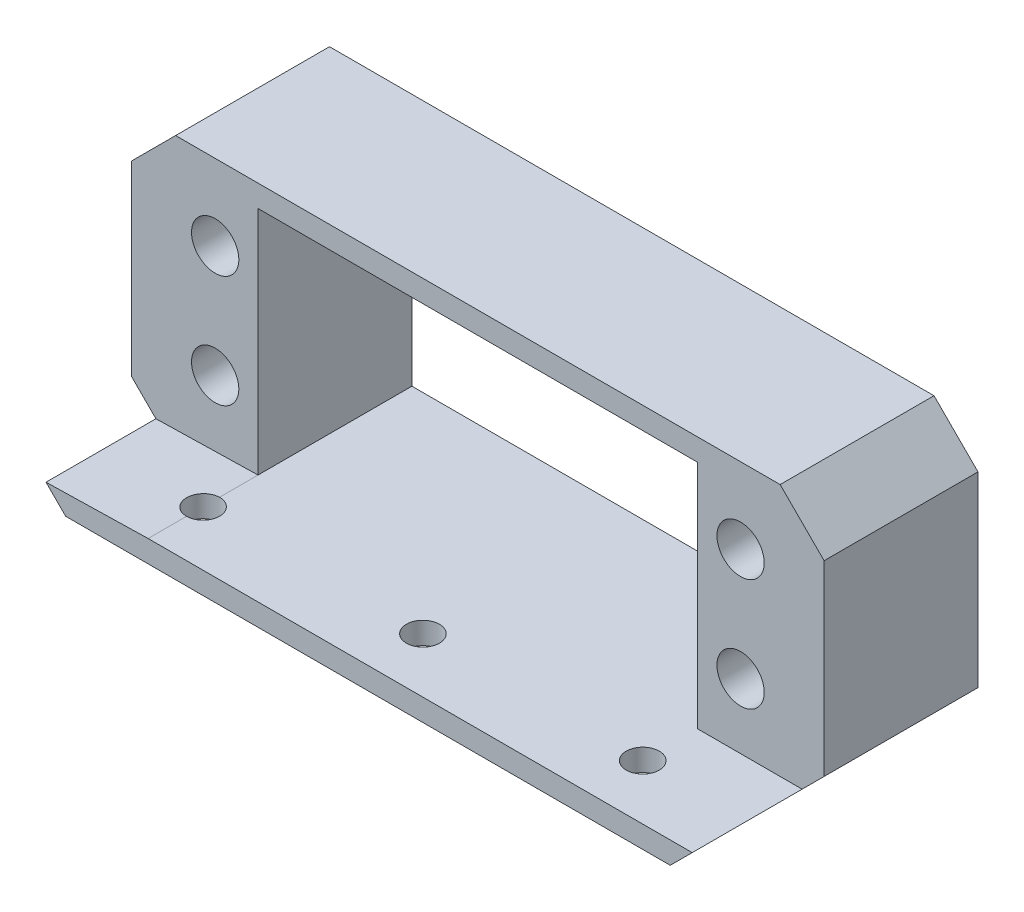
ISO-10303-21;
HEADER;
FILE_DESCRIPTION(('STEP AP214'),'2;1');
FILE_NAME('part.step','',(''),(''),'','','');
FILE_SCHEMA(('AUTOMOTIVE_DESIGN { 1 0 10303 214 1 1 1 1 }'));
ENDSEC;
DATA;
#1=APPLICATION_CONTEXT('core data for automotive mechanical design processes');
#2=APPLICATION_PROTOCOL_DEFINITION('international standard','automotive_design',2000,#1);
#3=PRODUCT_CONTEXT('',#1,'mechanical');
#4=PRODUCT('Part','Part','',(#3));
#5=PRODUCT_RELATED_PRODUCT_CATEGORY('part','',(#4));
#6=PRODUCT_DEFINITION_FORMATION('','',#4);
#7=PRODUCT_DEFINITION_CONTEXT('part definition',#1,'design');
#8=PRODUCT_DEFINITION('design','',#6,#7);
#9=PRODUCT_DEFINITION_SHAPE('','',#8);
#10=(LENGTH_UNIT() NAMED_UNIT(*) SI_UNIT(.MILLI.,.METRE.));
#11=(NAMED_UNIT(*) PLANE_ANGLE_UNIT() SI_UNIT($,.RADIAN.));
#12=(NAMED_UNIT(*) SI_UNIT($,.STERADIAN.) SOLID_ANGLE_UNIT());
#13=UNCERTAINTY_MEASURE_WITH_UNIT(LENGTH_MEASURE(1.E-05),#10,'distance_accuracy_value','');
#14=(GEOMETRIC_REPRESENTATION_CONTEXT(3) GLOBAL_UNCERTAINTY_ASSIGNED_CONTEXT((#13)) GLOBAL_UNIT_ASSIGNED_CONTEXT((#10,
#11,#12)) REPRESENTATION_CONTEXT('',''));
#15=CARTESIAN_POINT('',(0.,0.,0.));
#16=DIRECTION('',(0.,0.,1.));
#17=DIRECTION('',(1.,0.,0.));
#18=AXIS2_PLACEMENT_3D('',#15,#16,#17);
#19=CARTESIAN_POINT('',(0.,0.,14.));
#20=DIRECTION('',(0.,0.,1.));
#21=DIRECTION('',(1.,0.,0.));
#22=AXIS2_PLACEMENT_3D('',#19,#20,#21);
#23=PLANE('',#22);
#24=DIRECTION('',(-0.999745415991808,-0.0225633154338214,0.));
#25=VECTOR('',#24,1.);
#26=CARTESIAN_POINT('',(-20.,-10.5,14.));
#27=LINE('',#26,#25);
#28=CARTESIAN_POINT('',(-20.,-10.5,14.));
#29=VERTEX_POINT('',#28);
#30=CARTESIAN_POINT('',(-29.2903260629278,-10.7096739370722,14.));
#31=VERTEX_POINT('',#30);
#32=EDGE_CURVE('E281',#29,#31,#27,.T.);
#33=ORIENTED_EDGE('',*,*,#32,.F.);
#34=DIRECTION('',(0.,-1.,0.));
#35=VECTOR('',#34,1.);
#36=CARTESIAN_POINT('',(-20.,10.5,14.));
#37=LINE('',#36,#35);
#38=CARTESIAN_POINT('',(-20.,10.5,14.));
#39=VERTEX_POINT('',#38);
#40=EDGE_CURVE('E199',#39,#29,#37,.T.);
#41=ORIENTED_EDGE('',*,*,#40,.F.);
#42=DIRECTION('',(-1.,0.,0.));
#43=VECTOR('',#42,1.);
#44=CARTESIAN_POINT('',(-20.,10.5,14.));
#45=LINE('',#44,#43);
#46=CARTESIAN_POINT('',(20.,10.5,14.));
#47=VERTEX_POINT('',#46);
#48=EDGE_CURVE('E196',#47,#39,#45,.T.);
#49=ORIENTED_EDGE('',*,*,#48,.F.);
#50=DIRECTION('',(0.,1.,0.));
#51=VECTOR('',#50,1.);
#52=CARTESIAN_POINT('',(20.,10.5,14.));
#53=LINE('',#52,#51);
#54=CARTESIAN_POINT('',(20.,-10.5,14.));
#55=VERTEX_POINT('',#54);
#56=EDGE_CURVE('E194',#55,#47,#53,.T.);
#57=ORIENTED_EDGE('',*,*,#56,.F.);
#58=DIRECTION('',(-1.,0.,0.));
#59=VECTOR('',#58,1.);
#60=CARTESIAN_POINT('',(-20.,-10.5,14.));
#61=LINE('',#60,#59);
#62=CARTESIAN_POINT('',(29.5,-10.5,14.));
#63=VERTEX_POINT('',#62);
#64=EDGE_CURVE('E278',#63,#55,#61,.T.);
#65=ORIENTED_EDGE('',*,*,#64,.F.);
#66=DIRECTION('',(0.707106781186548,0.707106781186547,0.));
#67=VECTOR('',#66,1.);
#68=CARTESIAN_POINT('',(27.5,-12.5,14.));
#69=LINE('',#68,#67);
#70=CARTESIAN_POINT('',(31.5,-8.49999999999999,14.));
#71=VERTEX_POINT('',#70);
#72=EDGE_CURVE('E233',#63,#71,#69,.T.);
#73=ORIENTED_EDGE('',*,*,#72,.T.);
#74=DIRECTION('',(0.,1.,0.));
#75=VECTOR('',#74,1.);
#76=CARTESIAN_POINT('',(31.5,8.5,14.));
#77=LINE('',#76,#75);
#78=CARTESIAN_POINT('',(31.5,8.5,14.));
#79=VERTEX_POINT('',#78);
#80=EDGE_CURVE('E235',#71,#79,#77,.T.);
#81=ORIENTED_EDGE('',*,*,#80,.T.);
#82=DIRECTION('',(-0.707106781186548,0.707106781186547,0.));
#83=VECTOR('',#82,1.);
#84=CARTESIAN_POINT('',(27.5,12.5,14.));
#85=LINE('',#84,#83);
#86=CARTESIAN_POINT('',(27.5,12.5,14.));
#87=VERTEX_POINT('',#86);
#88=EDGE_CURVE('E220',#79,#87,#85,.T.);
#89=ORIENTED_EDGE('',*,*,#88,.T.);
#90=DIRECTION('',(-1.,0.,0.));
#91=VECTOR('',#90,1.);
#92=CARTESIAN_POINT('',(-27.5,12.5,14.));
#93=LINE('',#92,#91);
#94=CARTESIAN_POINT('',(-27.5,12.5,14.));
#95=VERTEX_POINT('',#94);
#96=EDGE_CURVE('E223',#87,#95,#93,.T.);
#97=ORIENTED_EDGE('',*,*,#96,.T.);
#98=DIRECTION('',(-0.707106781186548,-0.707106781186547,0.));
#99=VECTOR('',#98,1.);
#100=CARTESIAN_POINT('',(-27.5,12.5,14.));
#101=LINE('',#100,#99);
#102=CARTESIAN_POINT('',(-31.5,8.5,14.));
#103=VERTEX_POINT('',#102);
#104=EDGE_CURVE('E226',#95,#103,#101,.T.);
#105=ORIENTED_EDGE('',*,*,#104,.T.);
#106=DIRECTION('',(0.,-1.,0.));
#107=VECTOR('',#106,1.);
#108=CARTESIAN_POINT('',(-31.5,8.5,14.));
#109=LINE('',#108,#107);
#110=CARTESIAN_POINT('',(-31.5,-8.49999999999999,14.));
#111=VERTEX_POINT('',#110);
#112=EDGE_CURVE('E228',#103,#111,#109,.T.);
#113=ORIENTED_EDGE('',*,*,#112,.T.);
#114=DIRECTION('',(0.707106781186548,-0.707106781186547,0.));
#115=VECTOR('',#114,1.);
#116=CARTESIAN_POINT('',(-27.5,-12.5,14.));
#117=LINE('',#116,#115);
#118=EDGE_CURVE('E230',#111,#31,#117,.T.);
#119=ORIENTED_EDGE('',*,*,#118,.T.);
#120=EDGE_LOOP('',(#33,#41,#49,#57,#65,#73,#81,#89,#97,#105,#113,#119));
#121=FACE_BOUND('',#120,.T.);
#122=CARTESIAN_POINT('',(23.9,-4.60000000000001,14.));
#123=DIRECTION('',(0.,0.,-1.));
#124=DIRECTION('',(-1.,0.,0.));
#125=AXIS2_PLACEMENT_3D('',#122,#123,#124);
#126=CIRCLE('',#125,2.15);
#127=CARTESIAN_POINT('',(21.75,-4.60000000000001,14.));
#128=VERTEX_POINT('',#127);
#129=EDGE_CURVE('E177',#128,#128,#126,.T.);
#130=ORIENTED_EDGE('',*,*,#129,.T.);
#131=EDGE_LOOP('',(#130));
#132=FACE_BOUND('',#131,.T.);
#133=CARTESIAN_POINT('',(-23.8999999999999,5.59999999999998,14.));
#134=DIRECTION('',(0.,0.,-1.));
#135=DIRECTION('',(-1.,0.,0.));
#136=AXIS2_PLACEMENT_3D('',#133,#134,#135);
#137=CIRCLE('',#136,2.15);
#138=CARTESIAN_POINT('',(-26.0499999999999,5.59999999999998,14.));
#139=VERTEX_POINT('',#138);
#140=EDGE_CURVE('E184',#139,#139,#137,.T.);
#141=ORIENTED_EDGE('',*,*,#140,.T.);
#142=EDGE_LOOP('',(#141));
#143=FACE_BOUND('',#142,.T.);
#144=CARTESIAN_POINT('',(-23.8999999999999,-4.60000000000001,14.));
#145=DIRECTION('',(0.,0.,-1.));
#146=DIRECTION('',(-1.,0.,0.));
#147=AXIS2_PLACEMENT_3D('',#144,#145,#146);
#148=CIRCLE('',#147,2.15);
#149=CARTESIAN_POINT('',(-26.05,-4.60000000000001,14.));
#150=VERTEX_POINT('',#149);
#151=EDGE_CURVE('E171',#150,#150,#148,.T.);
#152=ORIENTED_EDGE('',*,*,#151,.T.);
#153=EDGE_LOOP('',(#152));
#154=FACE_BOUND('',#153,.T.);
#155=CARTESIAN_POINT('',(23.9,5.59999999999999,14.));
#156=DIRECTION('',(0.,0.,-1.));
#157=DIRECTION('',(-1.,0.,0.));
#158=AXIS2_PLACEMENT_3D('',#155,#156,#157);
#159=CIRCLE('',#158,2.15);
#160=CARTESIAN_POINT('',(21.75,5.59999999999999,14.));
#161=VERTEX_POINT('',#160);
#162=EDGE_CURVE('E189',#161,#161,#159,.T.);
#163=ORIENTED_EDGE('',*,*,#162,.T.);
#164=EDGE_LOOP('',(#163));
#165=FACE_BOUND('',#164,.T.);
#166=ADVANCED_FACE('F33',(#121,#132,#143,#154,#165),#23,.T.);
#167=CARTESIAN_POINT('',(0.,0.,0.));
#168=DIRECTION('',(0.,0.,1.));
#169=DIRECTION('',(1.,0.,0.));
#170=AXIS2_PLACEMENT_3D('',#167,#168,#169);
#171=PLANE('',#170);
#172=CARTESIAN_POINT('',(23.9,-4.60000000000001,0.));
#173=DIRECTION('',(0.,0.,-1.));
#174=DIRECTION('',(-1.,0.,0.));
#175=AXIS2_PLACEMENT_3D('',#172,#173,#174);
#176=CIRCLE('',#175,2.15);
#177=CARTESIAN_POINT('',(21.75,-4.60000000000001,0.));
#178=VERTEX_POINT('',#177);
#179=EDGE_CURVE('E181',#178,#178,#176,.T.);
#180=ORIENTED_EDGE('',*,*,#179,.F.);
#181=EDGE_LOOP('',(#180));
#182=FACE_BOUND('',#181,.T.);
#183=CARTESIAN_POINT('',(-23.8999999999999,5.59999999999998,0.));
#184=DIRECTION('',(0.,0.,-1.));
#185=DIRECTION('',(-1.,0.,0.));
#186=AXIS2_PLACEMENT_3D('',#183,#184,#185);
#187=CIRCLE('',#186,2.15);
#188=CARTESIAN_POINT('',(-26.0499999999999,5.59999999999998,0.));
#189=VERTEX_POINT('',#188);
#190=EDGE_CURVE('E174',#189,#189,#187,.T.);
#191=ORIENTED_EDGE('',*,*,#190,.F.);
#192=EDGE_LOOP('',(#191));
#193=FACE_BOUND('',#192,.T.);
#194=CARTESIAN_POINT('',(-23.8999999999999,-4.60000000000001,0.));
#195=DIRECTION('',(0.,0.,-1.));
#196=DIRECTION('',(-1.,0.,0.));
#197=AXIS2_PLACEMENT_3D('',#194,#195,#196);
#198=CIRCLE('',#197,2.15);
#199=CARTESIAN_POINT('',(-26.05,-4.60000000000001,0.));
#200=VERTEX_POINT('',#199);
#201=EDGE_CURVE('E165',#200,#200,#198,.T.);
#202=ORIENTED_EDGE('',*,*,#201,.F.);
#203=EDGE_LOOP('',(#202));
#204=FACE_BOUND('',#203,.T.);
#205=CARTESIAN_POINT('',(23.9,5.59999999999999,0.));
#206=DIRECTION('',(0.,0.,-1.));
#207=DIRECTION('',(-1.,0.,0.));
#208=AXIS2_PLACEMENT_3D('',#205,#206,#207);
#209=CIRCLE('',#208,2.15);
#210=CARTESIAN_POINT('',(21.75,5.59999999999999,0.));
#211=VERTEX_POINT('',#210);
#212=EDGE_CURVE('E180',#211,#211,#209,.T.);
#213=ORIENTED_EDGE('',*,*,#212,.F.);
#214=EDGE_LOOP('',(#213));
#215=FACE_BOUND('',#214,.T.);
#216=DIRECTION('',(-0.707106781186548,0.707106781186547,0.));
#217=VECTOR('',#216,1.);
#218=CARTESIAN_POINT('',(27.5,12.5,0.));
#219=LINE('',#218,#217);
#220=CARTESIAN_POINT('',(31.5,8.5,0.));
#221=VERTEX_POINT('',#220);
#222=CARTESIAN_POINT('',(27.5,12.5,0.));
#223=VERTEX_POINT('',#222);
#224=EDGE_CURVE('E219',#221,#223,#219,.T.);
#225=ORIENTED_EDGE('',*,*,#224,.F.);
#226=DIRECTION('',(0.,1.,0.));
#227=VECTOR('',#226,1.);
#228=CARTESIAN_POINT('',(31.5,8.5,0.));
#229=LINE('',#228,#227);
#230=CARTESIAN_POINT('',(31.5,-8.49999999999999,0.));
#231=VERTEX_POINT('',#230);
#232=EDGE_CURVE('E224',#231,#221,#229,.T.);
#233=ORIENTED_EDGE('',*,*,#232,.F.);
#234=DIRECTION('',(0.707106781186548,0.707106781186547,0.));
#235=VECTOR('',#234,1.);
#236=CARTESIAN_POINT('',(27.5,-12.5,0.));
#237=LINE('',#236,#235);
#238=CARTESIAN_POINT('',(27.5,-12.5,0.));
#239=VERTEX_POINT('',#238);
#240=EDGE_CURVE('E250',#239,#231,#237,.T.);
#241=ORIENTED_EDGE('',*,*,#240,.F.);
#242=DIRECTION('',(1.,0.,0.));
#243=VECTOR('',#242,1.);
#244=CARTESIAN_POINT('',(-27.5,-12.5,0.));
#245=LINE('',#244,#243);
#246=CARTESIAN_POINT('',(-27.5,-12.5,0.));
#247=VERTEX_POINT('',#246);
#248=EDGE_CURVE('E248',#247,#239,#245,.T.);
#249=ORIENTED_EDGE('',*,*,#248,.F.);
#250=DIRECTION('',(0.707106781186548,-0.707106781186547,0.));
#251=VECTOR('',#250,1.);
#252=CARTESIAN_POINT('',(-27.5,-12.5,0.));
#253=LINE('',#252,#251);
#254=CARTESIAN_POINT('',(-31.5,-8.49999999999999,0.));
#255=VERTEX_POINT('',#254);
#256=EDGE_CURVE('E246',#255,#247,#253,.T.);
#257=ORIENTED_EDGE('',*,*,#256,.F.);
#258=DIRECTION('',(0.,-1.,0.));
#259=VECTOR('',#258,1.);
#260=CARTESIAN_POINT('',(-31.5,8.5,0.));
#261=LINE('',#260,#259);
#262=CARTESIAN_POINT('',(-31.5,8.5,0.));
#263=VERTEX_POINT('',#262);
#264=EDGE_CURVE('E244',#263,#255,#261,.T.);
#265=ORIENTED_EDGE('',*,*,#264,.F.);
#266=DIRECTION('',(-0.707106781186548,-0.707106781186547,0.));
#267=VECTOR('',#266,1.);
#268=CARTESIAN_POINT('',(-27.5,12.5,0.));
#269=LINE('',#268,#267);
#270=CARTESIAN_POINT('',(-27.5,12.5,0.));
#271=VERTEX_POINT('',#270);
#272=EDGE_CURVE('E242',#271,#263,#269,.T.);
#273=ORIENTED_EDGE('',*,*,#272,.F.);
#274=DIRECTION('',(-1.,0.,0.));
#275=VECTOR('',#274,1.);
#276=CARTESIAN_POINT('',(-27.5,12.5,0.));
#277=LINE('',#276,#275);
#278=EDGE_CURVE('E240',#223,#271,#277,.T.);
#279=ORIENTED_EDGE('',*,*,#278,.F.);
#280=EDGE_LOOP('',(#225,#233,#241,#249,#257,#265,#273,#279));
#281=FACE_BOUND('',#280,.T.);
#282=DIRECTION('',(0.,1.,0.));
#283=VECTOR('',#282,1.);
#284=CARTESIAN_POINT('',(20.,10.5,0.));
#285=LINE('',#284,#283);
#286=CARTESIAN_POINT('',(20.,-10.5,0.));
#287=VERTEX_POINT('',#286);
#288=CARTESIAN_POINT('',(20.,10.5,0.));
#289=VERTEX_POINT('',#288);
#290=EDGE_CURVE('E56',#287,#289,#285,.T.);
#291=ORIENTED_EDGE('',*,*,#290,.T.);
#292=DIRECTION('',(-1.,0.,0.));
#293=VECTOR('',#292,1.);
#294=CARTESIAN_POINT('',(-20.,10.5,0.));
#295=LINE('',#294,#293);
#296=CARTESIAN_POINT('',(-20.,10.5,0.));
#297=VERTEX_POINT('',#296);
#298=EDGE_CURVE('E204',#289,#297,#295,.T.);
#299=ORIENTED_EDGE('',*,*,#298,.T.);
#300=DIRECTION('',(0.,-1.,0.));
#301=VECTOR('',#300,1.);
#302=CARTESIAN_POINT('',(-20.,10.5,0.));
#303=LINE('',#302,#301);
#304=CARTESIAN_POINT('',(-20.,-10.5,0.));
#305=VERTEX_POINT('',#304);
#306=EDGE_CURVE('E207',#297,#305,#303,.T.);
#307=ORIENTED_EDGE('',*,*,#306,.T.);
#308=DIRECTION('',(1.,0.,0.));
#309=VECTOR('',#308,1.);
#310=CARTESIAN_POINT('',(-20.,-10.5,0.));
#311=LINE('',#310,#309);
#312=EDGE_CURVE('E197',#305,#287,#311,.T.);
#313=ORIENTED_EDGE('',*,*,#312,.T.);
#314=EDGE_LOOP('',(#291,#299,#307,#313));
#315=FACE_BOUND('',#314,.T.);
#316=ADVANCED_FACE('F326',(#182,#193,#204,#215,#281,#315),#171,.F.);
#317=CARTESIAN_POINT('',(27.5,12.5,14.));
#318=DIRECTION('',(-0.707106781186547,-0.707106781186548,0.));
#319=DIRECTION('',(0.707106781186548,-0.707106781186547,0.));
#320=AXIS2_PLACEMENT_3D('',#317,#318,#319);
#321=PLANE('',#320);
#322=ORIENTED_EDGE('',*,*,#224,.T.);
#323=DIRECTION('',(0.,0.,-1.));
#324=VECTOR('',#323,1.);
#325=CARTESIAN_POINT('',(27.5,12.5,14.));
#326=LINE('',#325,#324);
#327=EDGE_CURVE('E42',#87,#223,#326,.T.);
#328=ORIENTED_EDGE('',*,*,#327,.F.);
#329=ORIENTED_EDGE('',*,*,#88,.F.);
#330=DIRECTION('',(0.,0.,-1.));
#331=VECTOR('',#330,1.);
#332=CARTESIAN_POINT('',(31.5,8.5,14.));
#333=LINE('',#332,#331);
#334=EDGE_CURVE('E237',#79,#221,#333,.T.);
#335=ORIENTED_EDGE('',*,*,#334,.T.);
#336=EDGE_LOOP('',(#322,#328,#329,#335));
#337=FACE_BOUND('',#336,.T.);
#338=ADVANCED_FACE('F35',(#337),#321,.F.);
#339=CARTESIAN_POINT('',(-27.5,12.5,14.));
#340=DIRECTION('',(0.,-1.,0.));
#341=DIRECTION('',(0.,0.,-1.));
#342=AXIS2_PLACEMENT_3D('',#339,#340,#341);
#343=PLANE('',#342);
#344=ORIENTED_EDGE('',*,*,#278,.T.);
#345=DIRECTION('',(0.,0.,-1.));
#346=VECTOR('',#345,1.);
#347=CARTESIAN_POINT('',(-27.5,12.5,14.));
#348=LINE('',#347,#346);
#349=EDGE_CURVE('E270',#95,#271,#348,.T.);
#350=ORIENTED_EDGE('',*,*,#349,.F.);
#351=ORIENTED_EDGE('',*,*,#96,.F.);
#352=ORIENTED_EDGE('',*,*,#327,.T.);
#353=EDGE_LOOP('',(#344,#350,#351,#352));
#354=FACE_BOUND('',#353,.T.);
#355=ADVANCED_FACE('F358',(#354),#343,.F.);
#356=CARTESIAN_POINT('',(-27.5,12.5,14.));
#357=DIRECTION('',(0.707106781186547,-0.707106781186548,0.));
#358=DIRECTION('',(0.707106781186548,0.707106781186547,0.));
#359=AXIS2_PLACEMENT_3D('',#356,#357,#358);
#360=PLANE('',#359);
#361=ORIENTED_EDGE('',*,*,#272,.T.);
#362=DIRECTION('',(0.,0.,-1.));
#363=VECTOR('',#362,1.);
#364=CARTESIAN_POINT('',(-31.5,8.5,14.));
#365=LINE('',#364,#363);
#366=EDGE_CURVE('E267',#103,#263,#365,.T.);
#367=ORIENTED_EDGE('',*,*,#366,.F.);
#368=ORIENTED_EDGE('',*,*,#104,.F.);
#369=ORIENTED_EDGE('',*,*,#349,.T.);
#370=EDGE_LOOP('',(#361,#367,#368,#369));
#371=FACE_BOUND('',#370,.T.);
#372=ADVANCED_FACE('F356',(#371),#360,.F.);
#373=CARTESIAN_POINT('',(-31.5,8.5,14.));
#374=DIRECTION('',(1.,0.,0.));
#375=DIRECTION('',(0.,0.,-1.));
#376=AXIS2_PLACEMENT_3D('',#373,#374,#375);
#377=PLANE('',#376);
#378=ORIENTED_EDGE('',*,*,#264,.T.);
#379=DIRECTION('',(0.,0.,-1.));
#380=VECTOR('',#379,1.);
#381=CARTESIAN_POINT('',(-31.5,-8.49999999999999,14.));
#382=LINE('',#381,#380);
#383=EDGE_CURVE('E264',#111,#255,#382,.T.);
#384=ORIENTED_EDGE('',*,*,#383,.F.);
#385=ORIENTED_EDGE('',*,*,#112,.F.);
#386=ORIENTED_EDGE('',*,*,#366,.T.);
#387=EDGE_LOOP('',(#378,#384,#385,#386));
#388=FACE_BOUND('',#387,.T.);
#389=ADVANCED_FACE('F351',(#388),#377,.F.);
#390=CARTESIAN_POINT('',(-27.5,-12.5,14.));
#391=DIRECTION('',(0.707106781186547,0.707106781186548,0.));
#392=DIRECTION('',(-0.707106781186548,0.707106781186547,0.));
#393=AXIS2_PLACEMENT_3D('',#390,#391,#392);
#394=PLANE('',#393);
#395=ORIENTED_EDGE('',*,*,#256,.T.);
#396=DIRECTION('',(0.,0.,-1.));
#397=VECTOR('',#396,1.);
#398=CARTESIAN_POINT('',(-27.5,-12.5,14.));
#399=LINE('',#398,#397);
#400=CARTESIAN_POINT('',(-27.5,-12.5,24.));
#401=VERTEX_POINT('',#400);
#402=EDGE_CURVE('E261',#401,#247,#399,.T.);
#403=ORIENTED_EDGE('',*,*,#402,.F.);
#404=DIRECTION('',(0.707106781186548,-0.707106781186547,0.));
#405=VECTOR('',#404,1.);
#406=CARTESIAN_POINT('',(-29.2903260629278,-10.7096739370722,24.));
#407=LINE('',#406,#405);
#408=CARTESIAN_POINT('',(-29.2903260629278,-10.7096739370722,24.));
#409=VERTEX_POINT('',#408);
#410=EDGE_CURVE('E284',#409,#401,#407,.T.);
#411=ORIENTED_EDGE('',*,*,#410,.F.);
#412=DIRECTION('',(0.,0.,-1.));
#413=VECTOR('',#412,1.);
#414=CARTESIAN_POINT('',(-29.2903260629278,-10.7096739370722,24.));
#415=LINE('',#414,#413);
#416=EDGE_CURVE('E167',#409,#31,#415,.T.);
#417=ORIENTED_EDGE('',*,*,#416,.T.);
#418=ORIENTED_EDGE('',*,*,#118,.F.);
#419=ORIENTED_EDGE('',*,*,#383,.T.);
#420=EDGE_LOOP('',(#395,#403,#411,#417,#418,#419));
#421=FACE_BOUND('',#420,.T.);
#422=ADVANCED_FACE('F309',(#421),#394,.F.);
#423=CARTESIAN_POINT('',(-27.5,-12.5,14.));
#424=DIRECTION('',(0.,1.,0.));
#425=DIRECTION('',(0.,0.,1.));
#426=AXIS2_PLACEMENT_3D('',#423,#424,#425);
#427=PLANE('',#426);
#428=CARTESIAN_POINT('',(-20.,-12.5,19.));
#429=DIRECTION('',(0.,-1.,0.));
#430=DIRECTION('',(0.,0.,-1.));
#431=AXIS2_PLACEMENT_3D('',#428,#429,#430);
#432=CIRCLE('',#431,1.5);
#433=CARTESIAN_POINT('',(-20.,-12.5,17.5));
#434=VERTEX_POINT('',#433);
#435=EDGE_CURVE('E158',#434,#434,#432,.T.);
#436=ORIENTED_EDGE('',*,*,#435,.F.);
#437=EDGE_LOOP('',(#436));
#438=FACE_BOUND('',#437,.T.);
#439=CARTESIAN_POINT('',(20.,-12.5,19.));
#440=DIRECTION('',(0.,-1.,0.));
#441=DIRECTION('',(0.,0.,1.));
#442=AXIS2_PLACEMENT_3D('',#439,#440,#441);
#443=CIRCLE('',#442,1.5);
#444=CARTESIAN_POINT('',(20.,-12.5,20.5));
#445=VERTEX_POINT('',#444);
#446=EDGE_CURVE('E299',#445,#445,#443,.T.);
#447=ORIENTED_EDGE('',*,*,#446,.F.);
#448=EDGE_LOOP('',(#447));
#449=FACE_BOUND('',#448,.T.);
#450=CARTESIAN_POINT('',(0.,-12.5,19.));
#451=DIRECTION('',(0.,-1.,0.));
#452=DIRECTION('',(0.,0.,-1.));
#453=AXIS2_PLACEMENT_3D('',#450,#451,#452);
#454=CIRCLE('',#453,1.5);
#455=CARTESIAN_POINT('',(0.,-12.5,17.5));
#456=VERTEX_POINT('',#455);
#457=EDGE_CURVE('E296',#456,#456,#454,.T.);
#458=ORIENTED_EDGE('',*,*,#457,.F.);
#459=EDGE_LOOP('',(#458));
#460=FACE_BOUND('',#459,.T.);
#461=ORIENTED_EDGE('',*,*,#248,.T.);
#462=DIRECTION('',(0.,0.,-1.));
#463=VECTOR('',#462,1.);
#464=CARTESIAN_POINT('',(27.5,-12.5,14.));
#465=LINE('',#464,#463);
#466=CARTESIAN_POINT('',(27.5,-12.5,24.));
#467=VERTEX_POINT('',#466);
#468=EDGE_CURVE('E258',#467,#239,#465,.T.);
#469=ORIENTED_EDGE('',*,*,#468,.F.);
#470=DIRECTION('',(1.,0.,0.));
#471=VECTOR('',#470,1.);
#472=CARTESIAN_POINT('',(-27.5,-12.5,24.));
#473=LINE('',#472,#471);
#474=EDGE_CURVE('E291',#401,#467,#473,.T.);
#475=ORIENTED_EDGE('',*,*,#474,.F.);
#476=ORIENTED_EDGE('',*,*,#402,.T.);
#477=EDGE_LOOP('',(#461,#469,#475,#476));
#478=FACE_BOUND('',#477,.T.);
#479=ADVANCED_FACE('F305',(#438,#449,#460,#478),#427,.F.);
#480=CARTESIAN_POINT('',(27.5,-12.5,14.));
#481=DIRECTION('',(-0.707106781186547,0.707106781186548,0.));
#482=DIRECTION('',(-0.707106781186548,-0.707106781186547,0.));
#483=AXIS2_PLACEMENT_3D('',#480,#481,#482);
#484=PLANE('',#483);
#485=ORIENTED_EDGE('',*,*,#240,.T.);
#486=DIRECTION('',(0.,0.,-1.));
#487=VECTOR('',#486,1.);
#488=CARTESIAN_POINT('',(31.5,-8.49999999999999,14.));
#489=LINE('',#488,#487);
#490=EDGE_CURVE('E255',#71,#231,#489,.T.);
#491=ORIENTED_EDGE('',*,*,#490,.F.);
#492=ORIENTED_EDGE('',*,*,#72,.F.);
#493=DIRECTION('',(0.,0.,-1.));
#494=VECTOR('',#493,1.);
#495=CARTESIAN_POINT('',(29.5,-10.5,24.));
#496=LINE('',#495,#494);
#497=CARTESIAN_POINT('',(29.5,-10.5,24.));
#498=VERTEX_POINT('',#497);
#499=EDGE_CURVE('E163',#498,#63,#496,.T.);
#500=ORIENTED_EDGE('',*,*,#499,.F.);
#501=DIRECTION('',(0.707106781186548,0.707106781186547,0.));
#502=VECTOR('',#501,1.);
#503=CARTESIAN_POINT('',(29.5,-10.5,24.));
#504=LINE('',#503,#502);
#505=EDGE_CURVE('E289',#467,#498,#504,.T.);
#506=ORIENTED_EDGE('',*,*,#505,.F.);
#507=ORIENTED_EDGE('',*,*,#468,.T.);
#508=EDGE_LOOP('',(#485,#491,#492,#500,#506,#507));
#509=FACE_BOUND('',#508,.T.);
#510=ADVANCED_FACE('F308',(#509),#484,.F.);
#511=CARTESIAN_POINT('',(31.5,8.5,14.));
#512=DIRECTION('',(-1.,0.,0.));
#513=DIRECTION('',(0.,0.,1.));
#514=AXIS2_PLACEMENT_3D('',#511,#512,#513);
#515=PLANE('',#514);
#516=ORIENTED_EDGE('',*,*,#232,.T.);
#517=ORIENTED_EDGE('',*,*,#334,.F.);
#518=ORIENTED_EDGE('',*,*,#80,.F.);
#519=ORIENTED_EDGE('',*,*,#490,.T.);
#520=EDGE_LOOP('',(#516,#517,#518,#519));
#521=FACE_BOUND('',#520,.T.);
#522=ADVANCED_FACE('F330',(#521),#515,.F.);
#523=CARTESIAN_POINT('',(20.,10.5,14.));
#524=DIRECTION('',(-1.,0.,0.));
#525=DIRECTION('',(0.,0.,1.));
#526=AXIS2_PLACEMENT_3D('',#523,#524,#525);
#527=PLANE('',#526);
#528=ORIENTED_EDGE('',*,*,#290,.F.);
#529=DIRECTION('',(0.,0.,-1.));
#530=VECTOR('',#529,1.);
#531=CARTESIAN_POINT('',(20.,-10.5,14.));
#532=LINE('',#531,#530);
#533=EDGE_CURVE('E202',#55,#287,#532,.T.);
#534=ORIENTED_EDGE('',*,*,#533,.F.);
#535=ORIENTED_EDGE('',*,*,#56,.T.);
#536=DIRECTION('',(0.,0.,-1.));
#537=VECTOR('',#536,1.);
#538=CARTESIAN_POINT('',(20.,10.5,14.));
#539=LINE('',#538,#537);
#540=EDGE_CURVE('E217',#47,#289,#539,.T.);
#541=ORIENTED_EDGE('',*,*,#540,.T.);
#542=EDGE_LOOP('',(#528,#534,#535,#541));
#543=FACE_BOUND('',#542,.T.);
#544=ADVANCED_FACE('F373',(#543),#527,.T.);
#545=CARTESIAN_POINT('',(-20.,10.5,14.));
#546=DIRECTION('',(0.,-1.,0.));
#547=DIRECTION('',(0.,0.,-1.));
#548=AXIS2_PLACEMENT_3D('',#545,#546,#547);
#549=PLANE('',#548);
#550=ORIENTED_EDGE('',*,*,#298,.F.);
#551=ORIENTED_EDGE('',*,*,#540,.F.);
#552=ORIENTED_EDGE('',*,*,#48,.T.);
#553=DIRECTION('',(0.,0.,-1.));
#554=VECTOR('',#553,1.);
#555=CARTESIAN_POINT('',(-20.,10.5,14.));
#556=LINE('',#555,#554);
#557=EDGE_CURVE('E215',#39,#297,#556,.T.);
#558=ORIENTED_EDGE('',*,*,#557,.T.);
#559=EDGE_LOOP('',(#550,#551,#552,#558));
#560=FACE_BOUND('',#559,.T.);
#561=ADVANCED_FACE('F412',(#560),#549,.T.);
#562=CARTESIAN_POINT('',(-20.,10.5,14.));
#563=DIRECTION('',(1.,0.,0.));
#564=DIRECTION('',(0.,1.,0.));
#565=AXIS2_PLACEMENT_3D('',#562,#563,#564);
#566=PLANE('',#565);
#567=ORIENTED_EDGE('',*,*,#306,.F.);
#568=ORIENTED_EDGE('',*,*,#557,.F.);
#569=ORIENTED_EDGE('',*,*,#40,.T.);
#570=DIRECTION('',(0.,0.,-1.));
#571=VECTOR('',#570,1.);
#572=CARTESIAN_POINT('',(-20.,-10.5,14.));
#573=LINE('',#572,#571);
#574=EDGE_CURVE('E213',#29,#305,#573,.T.);
#575=ORIENTED_EDGE('',*,*,#574,.T.);
#576=EDGE_LOOP('',(#567,#568,#569,#575));
#577=FACE_BOUND('',#576,.T.);
#578=ADVANCED_FACE('F418',(#577),#566,.T.);
#579=CARTESIAN_POINT('',(-20.,-10.5,14.));
#580=DIRECTION('',(0.,1.,0.));
#581=DIRECTION('',(0.,0.,1.));
#582=AXIS2_PLACEMENT_3D('',#579,#580,#581);
#583=PLANE('',#582);
#584=CARTESIAN_POINT('',(-20.,-10.5,19.));
#585=DIRECTION('',(0.,1.,0.));
#586=DIRECTION('',(0.,0.,1.));
#587=AXIS2_PLACEMENT_3D('',#584,#585,#586);
#588=CIRCLE('',#587,1.5);
#589=CARTESIAN_POINT('',(-20.,-10.5,20.5));
#590=VERTEX_POINT('',#589);
#591=CARTESIAN_POINT('',(-20.,-10.5,17.5));
#592=VERTEX_POINT('',#591);
#593=EDGE_CURVE('E49',#590,#592,#588,.T.);
#594=ORIENTED_EDGE('',*,*,#593,.F.);
#595=DIRECTION('',(0.,0.,-1.));
#596=VECTOR('',#595,1.);
#597=CARTESIAN_POINT('',(-20.,-10.5,24.));
#598=LINE('',#597,#596);
#599=CARTESIAN_POINT('',(-20.,-10.5,24.));
#600=VERTEX_POINT('',#599);
#601=EDGE_CURVE('E153',#600,#590,#598,.T.);
#602=ORIENTED_EDGE('',*,*,#601,.F.);
#603=DIRECTION('',(-1.,0.,0.));
#604=VECTOR('',#603,1.);
#605=CARTESIAN_POINT('',(20.,-10.5,24.));
#606=LINE('',#605,#604);
#607=EDGE_CURVE('E287',#498,#600,#606,.T.);
#608=ORIENTED_EDGE('',*,*,#607,.F.);
#609=ORIENTED_EDGE('',*,*,#499,.T.);
#610=ORIENTED_EDGE('',*,*,#64,.T.);
#611=ORIENTED_EDGE('',*,*,#533,.T.);
#612=ORIENTED_EDGE('',*,*,#312,.F.);
#613=ORIENTED_EDGE('',*,*,#574,.F.);
#614=EDGE_CURVE('E156',#592,#29,#598,.T.);
#615=ORIENTED_EDGE('',*,*,#614,.F.);
#616=EDGE_LOOP('',(#594,#602,#608,#609,#610,#611,#612,#613,#615));
#617=FACE_BOUND('',#616,.T.);
#618=CARTESIAN_POINT('',(20.,-10.5,19.));
#619=DIRECTION('',(0.,1.,0.));
#620=DIRECTION('',(0.,0.,1.));
#621=AXIS2_PLACEMENT_3D('',#618,#619,#620);
#622=CIRCLE('',#621,1.5);
#623=CARTESIAN_POINT('',(20.,-10.5,20.5));
#624=VERTEX_POINT('',#623);
#625=EDGE_CURVE('E37',#624,#624,#622,.T.);
#626=ORIENTED_EDGE('',*,*,#625,.F.);
#627=EDGE_LOOP('',(#626));
#628=FACE_BOUND('',#627,.T.);
#629=CARTESIAN_POINT('',(0.,-10.5,19.));
#630=DIRECTION('',(0.,1.,0.));
#631=DIRECTION('',(0.,0.,1.));
#632=AXIS2_PLACEMENT_3D('',#629,#630,#631);
#633=CIRCLE('',#632,1.5);
#634=CARTESIAN_POINT('',(0.,-10.5,20.5));
#635=VERTEX_POINT('',#634);
#636=EDGE_CURVE('E157',#635,#635,#633,.T.);
#637=ORIENTED_EDGE('',*,*,#636,.F.);
#638=EDGE_LOOP('',(#637));
#639=FACE_BOUND('',#638,.T.);
#640=ADVANCED_FACE('F150',(#617,#628,#639),#583,.T.);
#641=CARTESIAN_POINT('',(23.9,5.59999999999999,14.));
#642=DIRECTION('',(0.,0.,-1.));
#643=DIRECTION('',(-1.,0.,0.));
#644=AXIS2_PLACEMENT_3D('',#641,#642,#643);
#645=CYLINDRICAL_SURFACE('',#644,2.15);
#646=ORIENTED_EDGE('',*,*,#162,.F.);
#647=EDGE_LOOP('',(#646));
#648=FACE_BOUND('',#647,.T.);
#649=ORIENTED_EDGE('',*,*,#212,.T.);
#650=EDGE_LOOP('',(#649));
#651=FACE_BOUND('',#650,.T.);
#652=ADVANCED_FACE('F431',(#648,#651),#645,.F.);
#653=CARTESIAN_POINT('',(-23.8999999999999,-4.60000000000001,14.));
#654=DIRECTION('',(0.,0.,-1.));
#655=DIRECTION('',(-1.,0.,0.));
#656=AXIS2_PLACEMENT_3D('',#653,#654,#655);
#657=CYLINDRICAL_SURFACE('',#656,2.15);
#658=ORIENTED_EDGE('',*,*,#151,.F.);
#659=EDGE_LOOP('',(#658));
#660=FACE_BOUND('',#659,.T.);
#661=ORIENTED_EDGE('',*,*,#201,.T.);
#662=EDGE_LOOP('',(#661));
#663=FACE_BOUND('',#662,.T.);
#664=ADVANCED_FACE('F439',(#660,#663),#657,.F.);
#665=CARTESIAN_POINT('',(-23.8999999999999,5.59999999999998,14.));
#666=DIRECTION('',(0.,0.,-1.));
#667=DIRECTION('',(-1.,0.,0.));
#668=AXIS2_PLACEMENT_3D('',#665,#666,#667);
#669=CYLINDRICAL_SURFACE('',#668,2.15);
#670=ORIENTED_EDGE('',*,*,#140,.F.);
#671=EDGE_LOOP('',(#670));
#672=FACE_BOUND('',#671,.T.);
#673=ORIENTED_EDGE('',*,*,#190,.T.);
#674=EDGE_LOOP('',(#673));
#675=FACE_BOUND('',#674,.T.);
#676=ADVANCED_FACE('F447',(#672,#675),#669,.F.);
#677=CARTESIAN_POINT('',(23.9,-4.60000000000001,14.));
#678=DIRECTION('',(0.,0.,-1.));
#679=DIRECTION('',(-1.,0.,0.));
#680=AXIS2_PLACEMENT_3D('',#677,#678,#679);
#681=CYLINDRICAL_SURFACE('',#680,2.15);
#682=ORIENTED_EDGE('',*,*,#129,.F.);
#683=EDGE_LOOP('',(#682));
#684=FACE_BOUND('',#683,.T.);
#685=ORIENTED_EDGE('',*,*,#179,.T.);
#686=EDGE_LOOP('',(#685));
#687=FACE_BOUND('',#686,.T.);
#688=ADVANCED_FACE('F455',(#684,#687),#681,.F.);
#689=CARTESIAN_POINT('',(-20.,-10.5,24.));
#690=DIRECTION('',(0.0225633154338214,-0.999745415991808,0.));
#691=DIRECTION('',(0.999745415991808,0.0225633154338214,0.));
#692=AXIS2_PLACEMENT_3D('',#689,#690,#691);
#693=PLANE('',#692);
#694=ORIENTED_EDGE('',*,*,#601,.T.);
#695=CARTESIAN_POINT('',(-20.,-10.5,19.));
#696=DIRECTION('',(0.0225633154338214,-0.999745415991808,0.));
#697=DIRECTION('',(-0.999745415991808,-0.0225633154338214,0.));
#698=AXIS2_PLACEMENT_3D('',#695,#696,#697);
#699=ELLIPSE('',#698,1.50038197325657,1.5);
#700=EDGE_CURVE('E11',#590,#592,#699,.T.);
#701=ORIENTED_EDGE('',*,*,#700,.T.);
#702=ORIENTED_EDGE('',*,*,#614,.T.);
#703=ORIENTED_EDGE('',*,*,#32,.T.);
#704=ORIENTED_EDGE('',*,*,#416,.F.);
#705=DIRECTION('',(-0.999745415991808,-0.0225633154338214,0.));
#706=VECTOR('',#705,1.);
#707=CARTESIAN_POINT('',(-20.,-10.5,24.));
#708=LINE('',#707,#706);
#709=EDGE_CURVE('E162',#600,#409,#708,.T.);
#710=ORIENTED_EDGE('',*,*,#709,.F.);
#711=EDGE_LOOP('',(#694,#701,#702,#703,#704,#710));
#712=FACE_BOUND('',#711,.T.);
#713=ADVANCED_FACE('F160',(#712),#693,.F.);
#714=CARTESIAN_POINT('',(0.,0.,24.));
#715=DIRECTION('',(0.,0.,-1.));
#716=DIRECTION('',(-1.,0.,0.));
#717=AXIS2_PLACEMENT_3D('',#714,#715,#716);
#718=PLANE('',#717);
#719=ORIENTED_EDGE('',*,*,#410,.T.);
#720=ORIENTED_EDGE('',*,*,#474,.T.);
#721=ORIENTED_EDGE('',*,*,#505,.T.);
#722=ORIENTED_EDGE('',*,*,#607,.T.);
#723=ORIENTED_EDGE('',*,*,#709,.T.);
#724=EDGE_LOOP('',(#719,#720,#721,#722,#723));
#725=FACE_BOUND('',#724,.T.);
#726=ADVANCED_FACE('F342',(#725),#718,.F.);
#727=CARTESIAN_POINT('',(-20.,12.5,19.));
#728=DIRECTION('',(0.,-1.,0.));
#729=DIRECTION('',(0.,0.,-1.));
#730=AXIS2_PLACEMENT_3D('',#727,#728,#729);
#731=CYLINDRICAL_SURFACE('',#730,1.5);
#732=ORIENTED_EDGE('',*,*,#593,.T.);
#733=ORIENTED_EDGE('',*,*,#700,.F.);
#734=EDGE_LOOP('',(#732,#733));
#735=FACE_BOUND('',#734,.T.);
#736=ORIENTED_EDGE('',*,*,#435,.T.);
#737=EDGE_LOOP('',(#736));
#738=FACE_BOUND('',#737,.T.);
#739=ADVANCED_FACE('F143',(#735,#738),#731,.F.);
#740=CARTESIAN_POINT('',(0.,12.5,19.));
#741=DIRECTION('',(0.,-1.,0.));
#742=DIRECTION('',(0.,0.,-1.));
#743=AXIS2_PLACEMENT_3D('',#740,#741,#742);
#744=CYLINDRICAL_SURFACE('',#743,1.5);
#745=ORIENTED_EDGE('',*,*,#636,.T.);
#746=EDGE_LOOP('',(#745));
#747=FACE_BOUND('',#746,.T.);
#748=ORIENTED_EDGE('',*,*,#457,.T.);
#749=EDGE_LOOP('',(#748));
#750=FACE_BOUND('',#749,.T.);
#751=ADVANCED_FACE('F480',(#747,#750),#744,.F.);
#752=CARTESIAN_POINT('',(20.,12.5,19.));
#753=DIRECTION('',(0.,-1.,0.));
#754=DIRECTION('',(0.,0.,-1.));
#755=AXIS2_PLACEMENT_3D('',#752,#753,#754);
#756=CYLINDRICAL_SURFACE('',#755,1.5);
#757=ORIENTED_EDGE('',*,*,#625,.T.);
#758=EDGE_LOOP('',(#757));
#759=FACE_BOUND('',#758,.T.);
#760=ORIENTED_EDGE('',*,*,#446,.T.);
#761=EDGE_LOOP('',(#760));
#762=FACE_BOUND('',#761,.T.);
#763=ADVANCED_FACE('F487',(#759,#762),#756,.F.);
#764=CLOSED_SHELL('',(#166,#316,#338,#355,#372,#389,#422,#479,#510,#522,#544,#561,#578,#640,
#652,#664,#676,#688,#713,#726,#739,#751,#763));
#765=MANIFOLD_SOLID_BREP('B2',#764);
#766=ADVANCED_BREP_SHAPE_REPRESENTATION('',(#18,#765),#14);
#767=SHAPE_DEFINITION_REPRESENTATION(#9,#766);
ENDSEC;
END-ISO-10303-21;
